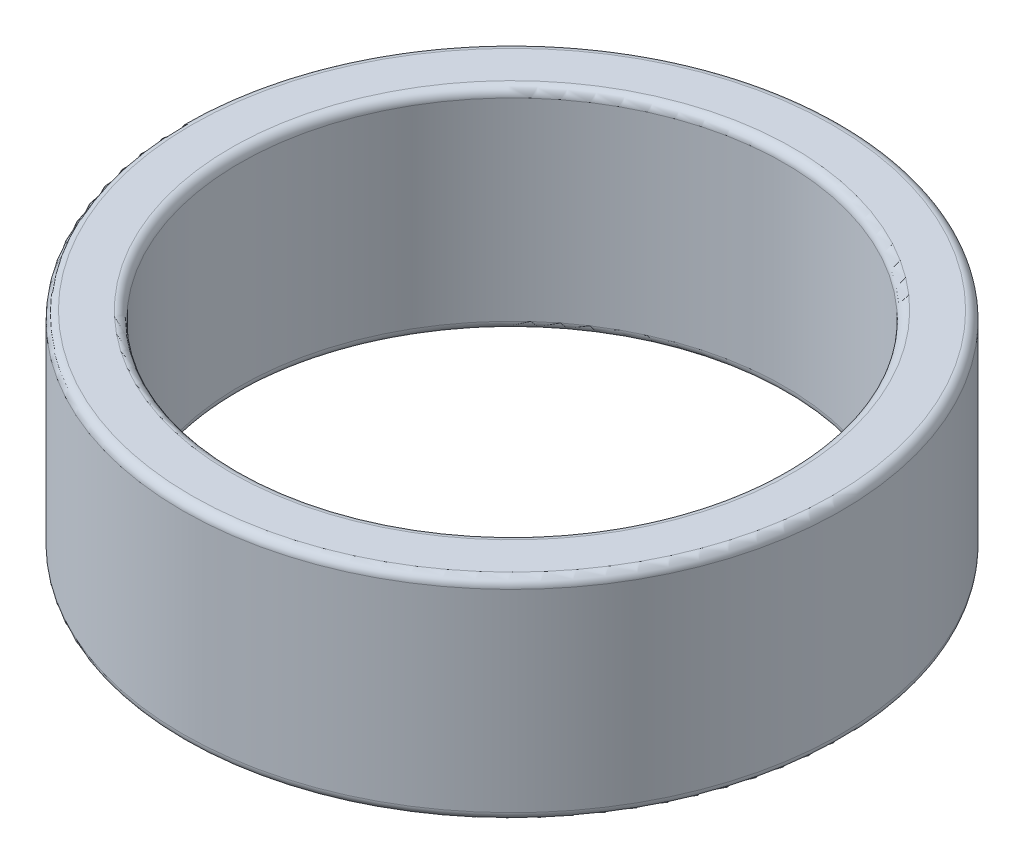
ISO-10303-21;
HEADER;
FILE_DESCRIPTION(('STEP AP214'),'2;1');
FILE_NAME('part.step','',(''),(''),'','','');
FILE_SCHEMA(('AUTOMOTIVE_DESIGN { 1 0 10303 214 1 1 1 1 }'));
ENDSEC;
DATA;
#1=APPLICATION_CONTEXT('core data for automotive mechanical design processes');
#2=APPLICATION_PROTOCOL_DEFINITION('international standard','automotive_design',2000,#1);
#3=PRODUCT_CONTEXT('',#1,'mechanical');
#4=PRODUCT('Part','Part','',(#3));
#5=PRODUCT_RELATED_PRODUCT_CATEGORY('part','',(#4));
#6=PRODUCT_DEFINITION_FORMATION('','',#4);
#7=PRODUCT_DEFINITION_CONTEXT('part definition',#1,'design');
#8=PRODUCT_DEFINITION('design','',#6,#7);
#9=PRODUCT_DEFINITION_SHAPE('','',#8);
#10=(LENGTH_UNIT() NAMED_UNIT(*) SI_UNIT(.MILLI.,.METRE.));
#11=(NAMED_UNIT(*) PLANE_ANGLE_UNIT() SI_UNIT($,.RADIAN.));
#12=(NAMED_UNIT(*) SI_UNIT($,.STERADIAN.) SOLID_ANGLE_UNIT());
#13=UNCERTAINTY_MEASURE_WITH_UNIT(LENGTH_MEASURE(1.E-05),#10,'distance_accuracy_value','');
#14=(GEOMETRIC_REPRESENTATION_CONTEXT(3) GLOBAL_UNCERTAINTY_ASSIGNED_CONTEXT((#13)) GLOBAL_UNIT_ASSIGNED_CONTEXT((#10,
#11,#12)) REPRESENTATION_CONTEXT('',''));
#15=CARTESIAN_POINT('',(0.,0.,0.));
#16=DIRECTION('',(0.,0.,1.));
#17=DIRECTION('',(1.,0.,0.));
#18=AXIS2_PLACEMENT_3D('',#15,#16,#17);
#19=CARTESIAN_POINT('',(0.,12.,0.));
#20=DIRECTION('',(0.,1.,0.));
#21=DIRECTION('',(0.,0.,1.));
#22=AXIS2_PLACEMENT_3D('',#19,#20,#21);
#23=PLANE('',#22);
#24=CARTESIAN_POINT('',(0.,12.,0.));
#25=DIRECTION('',(0.,1.,0.));
#26=DIRECTION('',(0.,0.,1.));
#27=AXIS2_PLACEMENT_3D('',#24,#25,#26);
#28=CIRCLE('',#27,16.);
#29=CARTESIAN_POINT('',(0.,12.,16.));
#30=VERTEX_POINT('',#29);
#31=EDGE_CURVE('E10',#30,#30,#28,.F.);
#32=ORIENTED_EDGE('',*,*,#31,.T.);
#33=EDGE_LOOP('',(#32));
#34=FACE_BOUND('',#33,.T.);
#35=CARTESIAN_POINT('',(0.,12.,0.));
#36=DIRECTION('',(0.,1.,0.));
#37=DIRECTION('',(0.,0.,1.));
#38=AXIS2_PLACEMENT_3D('',#35,#36,#37);
#39=CIRCLE('',#38,18.25);
#40=CARTESIAN_POINT('',(0.,12.,18.25));
#41=VERTEX_POINT('',#40);
#42=EDGE_CURVE('E37',#41,#41,#39,.T.);
#43=ORIENTED_EDGE('',*,*,#42,.T.);
#44=EDGE_LOOP('',(#43));
#45=FACE_BOUND('',#44,.T.);
#46=ADVANCED_FACE('F30',(#34,#45),#23,.T.);
#47=CARTESIAN_POINT('',(0.,0.,0.));
#48=DIRECTION('',(0.,1.,0.));
#49=DIRECTION('',(0.,0.,1.));
#50=AXIS2_PLACEMENT_3D('',#47,#48,#49);
#51=PLANE('',#50);
#52=CARTESIAN_POINT('',(0.,0.,0.));
#53=DIRECTION('',(0.,1.,0.));
#54=DIRECTION('',(0.,0.,1.));
#55=AXIS2_PLACEMENT_3D('',#52,#53,#54);
#56=CIRCLE('',#55,16.);
#57=CARTESIAN_POINT('',(0.,0.,16.));
#58=VERTEX_POINT('',#57);
#59=EDGE_CURVE('E56',#58,#58,#56,.T.);
#60=ORIENTED_EDGE('',*,*,#59,.T.);
#61=EDGE_LOOP('',(#60));
#62=FACE_BOUND('',#61,.T.);
#63=CARTESIAN_POINT('',(0.,0.,0.));
#64=DIRECTION('',(0.,1.,0.));
#65=DIRECTION('',(0.,0.,1.));
#66=AXIS2_PLACEMENT_3D('',#63,#64,#65);
#67=CIRCLE('',#66,18.25);
#68=CARTESIAN_POINT('',(0.,0.,18.25));
#69=VERTEX_POINT('',#68);
#70=EDGE_CURVE('E59',#69,#69,#67,.F.);
#71=ORIENTED_EDGE('',*,*,#70,.T.);
#72=EDGE_LOOP('',(#71));
#73=FACE_BOUND('',#72,.T.);
#74=ADVANCED_FACE('F63',(#62,#73),#51,.F.);
#75=CARTESIAN_POINT('',(0.,12.,0.));
#76=DIRECTION('',(0.,-1.,0.));
#77=DIRECTION('',(0.,0.,-1.));
#78=AXIS2_PLACEMENT_3D('',#75,#76,#77);
#79=CYLINDRICAL_SURFACE('',#78,18.75);
#80=CARTESIAN_POINT('',(0.,0.5,0.));
#81=DIRECTION('',(0.,1.,0.));
#82=DIRECTION('',(0.,0.,1.));
#83=AXIS2_PLACEMENT_3D('',#80,#81,#82);
#84=CIRCLE('',#83,18.75);
#85=CARTESIAN_POINT('',(0.,0.5,18.75));
#86=VERTEX_POINT('',#85);
#87=EDGE_CURVE('E41',#86,#86,#84,.T.);
#88=ORIENTED_EDGE('',*,*,#87,.T.);
#89=EDGE_LOOP('',(#88));
#90=FACE_BOUND('',#89,.T.);
#91=CARTESIAN_POINT('',(0.,11.5,0.));
#92=DIRECTION('',(0.,1.,0.));
#93=DIRECTION('',(0.,0.,1.));
#94=AXIS2_PLACEMENT_3D('',#91,#92,#93);
#95=CIRCLE('',#94,18.75);
#96=CARTESIAN_POINT('',(0.,11.5,18.75));
#97=VERTEX_POINT('',#96);
#98=EDGE_CURVE('E45',#97,#97,#95,.F.);
#99=ORIENTED_EDGE('',*,*,#98,.T.);
#100=EDGE_LOOP('',(#99));
#101=FACE_BOUND('',#100,.T.);
#102=ADVANCED_FACE('F73',(#90,#101),#79,.T.);
#103=CARTESIAN_POINT('',(0.,12.,0.));
#104=DIRECTION('',(0.,-1.,0.));
#105=DIRECTION('',(0.,0.,-1.));
#106=AXIS2_PLACEMENT_3D('',#103,#104,#105);
#107=CYLINDRICAL_SURFACE('',#106,15.5);
#108=CARTESIAN_POINT('',(0.,0.5,0.));
#109=DIRECTION('',(0.,1.,0.));
#110=DIRECTION('',(0.,0.,1.));
#111=AXIS2_PLACEMENT_3D('',#108,#109,#110);
#112=CIRCLE('',#111,15.5);
#113=CARTESIAN_POINT('',(0.,0.5,15.5));
#114=VERTEX_POINT('',#113);
#115=EDGE_CURVE('E50',#114,#114,#112,.F.);
#116=ORIENTED_EDGE('',*,*,#115,.T.);
#117=EDGE_LOOP('',(#116));
#118=FACE_BOUND('',#117,.T.);
#119=CARTESIAN_POINT('',(0.,11.5,0.));
#120=DIRECTION('',(0.,1.,0.));
#121=DIRECTION('',(0.,0.,1.));
#122=AXIS2_PLACEMENT_3D('',#119,#120,#121);
#123=CIRCLE('',#122,15.5);
#124=CARTESIAN_POINT('',(0.,11.5,15.5));
#125=VERTEX_POINT('',#124);
#126=EDGE_CURVE('E53',#125,#125,#123,.T.);
#127=ORIENTED_EDGE('',*,*,#126,.T.);
#128=EDGE_LOOP('',(#127));
#129=FACE_BOUND('',#128,.T.);
#130=ADVANCED_FACE('F76',(#118,#129),#107,.F.);
#131=CARTESIAN_POINT('',(0.,0.5,0.));
#132=DIRECTION('',(0.,1.,0.));
#133=DIRECTION('',(0.,0.,1.));
#134=AXIS2_PLACEMENT_3D('',#131,#132,#133);
#135=TOROIDAL_SURFACE('',#134,16.,0.5);
#136=ORIENTED_EDGE('',*,*,#115,.F.);
#137=EDGE_LOOP('',(#136));
#138=FACE_BOUND('',#137,.T.);
#139=ORIENTED_EDGE('',*,*,#59,.F.);
#140=EDGE_LOOP('',(#139));
#141=FACE_BOUND('',#140,.T.);
#142=ADVANCED_FACE('F69',(#138,#141),#135,.T.);
#143=CARTESIAN_POINT('',(0.,0.5,0.));
#144=DIRECTION('',(0.,1.,0.));
#145=DIRECTION('',(0.,0.,1.));
#146=AXIS2_PLACEMENT_3D('',#143,#144,#145);
#147=TOROIDAL_SURFACE('',#146,18.25,0.5);
#148=ORIENTED_EDGE('',*,*,#70,.F.);
#149=EDGE_LOOP('',(#148));
#150=FACE_BOUND('',#149,.T.);
#151=ORIENTED_EDGE('',*,*,#87,.F.);
#152=EDGE_LOOP('',(#151));
#153=FACE_BOUND('',#152,.T.);
#154=ADVANCED_FACE('F65',(#150,#153),#147,.T.);
#155=CARTESIAN_POINT('',(0.,11.5,0.));
#156=DIRECTION('',(0.,1.,0.));
#157=DIRECTION('',(0.,0.,1.));
#158=AXIS2_PLACEMENT_3D('',#155,#156,#157);
#159=TOROIDAL_SURFACE('',#158,16.,0.5);
#160=ORIENTED_EDGE('',*,*,#31,.F.);
#161=EDGE_LOOP('',(#160));
#162=FACE_BOUND('',#161,.T.);
#163=ORIENTED_EDGE('',*,*,#126,.F.);
#164=EDGE_LOOP('',(#163));
#165=FACE_BOUND('',#164,.T.);
#166=ADVANCED_FACE('F68',(#162,#165),#159,.T.);
#167=CARTESIAN_POINT('',(0.,11.5,0.));
#168=DIRECTION('',(0.,1.,0.));
#169=DIRECTION('',(0.,0.,1.));
#170=AXIS2_PLACEMENT_3D('',#167,#168,#169);
#171=TOROIDAL_SURFACE('',#170,18.25,0.5);
#172=ORIENTED_EDGE('',*,*,#98,.F.);
#173=EDGE_LOOP('',(#172));
#174=FACE_BOUND('',#173,.T.);
#175=ORIENTED_EDGE('',*,*,#42,.F.);
#176=EDGE_LOOP('',(#175));
#177=FACE_BOUND('',#176,.T.);
#178=ADVANCED_FACE('F32',(#174,#177),#171,.T.);
#179=CLOSED_SHELL('',(#46,#74,#102,#130,#142,#154,#166,#178));
#180=MANIFOLD_SOLID_BREP('B2',#179);
#181=ADVANCED_BREP_SHAPE_REPRESENTATION('',(#18,#180),#14);
#182=SHAPE_DEFINITION_REPRESENTATION(#9,#181);
ENDSEC;
END-ISO-10303-21;
